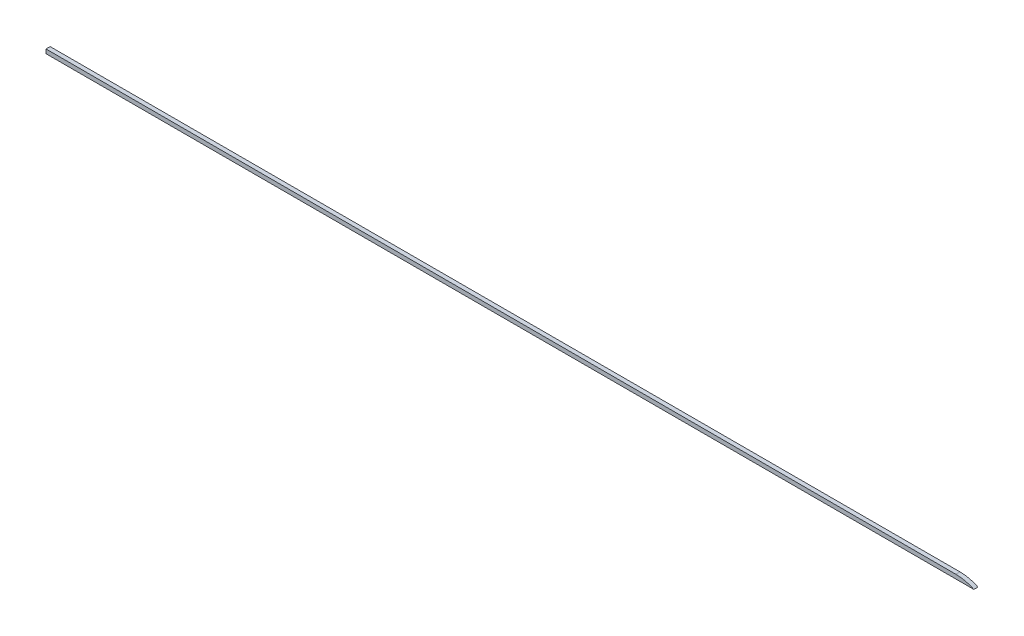
ISO-10303-21;
HEADER;
FILE_DESCRIPTION(('STEP AP214'),'2;1');
FILE_NAME('part.step','',(''),(''),'','','');
FILE_SCHEMA(('AUTOMOTIVE_DESIGN { 1 0 10303 214 1 1 1 1 }'));
ENDSEC;
DATA;
#1=APPLICATION_CONTEXT('core data for automotive mechanical design processes');
#2=APPLICATION_PROTOCOL_DEFINITION('international standard','automotive_design',2000,#1);
#3=PRODUCT_CONTEXT('',#1,'mechanical');
#4=PRODUCT('Part','Part','',(#3));
#5=PRODUCT_RELATED_PRODUCT_CATEGORY('part','',(#4));
#6=PRODUCT_DEFINITION_FORMATION('','',#4);
#7=PRODUCT_DEFINITION_CONTEXT('part definition',#1,'design');
#8=PRODUCT_DEFINITION('design','',#6,#7);
#9=PRODUCT_DEFINITION_SHAPE('','',#8);
#10=(LENGTH_UNIT() NAMED_UNIT(*) SI_UNIT(.MILLI.,.METRE.));
#11=(NAMED_UNIT(*) PLANE_ANGLE_UNIT() SI_UNIT($,.RADIAN.));
#12=(NAMED_UNIT(*) SI_UNIT($,.STERADIAN.) SOLID_ANGLE_UNIT());
#13=UNCERTAINTY_MEASURE_WITH_UNIT(LENGTH_MEASURE(1.E-05),#10,'distance_accuracy_value','');
#14=(GEOMETRIC_REPRESENTATION_CONTEXT(3) GLOBAL_UNCERTAINTY_ASSIGNED_CONTEXT((#13)) GLOBAL_UNIT_ASSIGNED_CONTEXT((#10,
#11,#12)) REPRESENTATION_CONTEXT('',''));
#15=CARTESIAN_POINT('',(0.,0.,0.));
#16=DIRECTION('',(0.,0.,1.));
#17=DIRECTION('',(1.,0.,0.));
#18=AXIS2_PLACEMENT_3D('',#15,#16,#17);
#19=CARTESIAN_POINT('',(-502.733741957931,0.,0.));
#20=DIRECTION('',(1.,0.,0.));
#21=DIRECTION('',(0.,0.,-1.));
#22=AXIS2_PLACEMENT_3D('',#19,#20,#21);
#23=PLANE('',#22);
#24=DIRECTION('',(0.,0.,1.));
#25=VECTOR('',#24,1.);
#26=CARTESIAN_POINT('',(-502.733741957931,45.,0.));
#27=LINE('',#26,#25);
#28=CARTESIAN_POINT('',(-502.733741957931,45.,0.));
#29=VERTEX_POINT('',#28);
#30=CARTESIAN_POINT('',(-502.733741957931,45.,5.));
#31=VERTEX_POINT('',#30);
#32=EDGE_CURVE('E83',#29,#31,#27,.T.);
#33=ORIENTED_EDGE('',*,*,#32,.T.);
#34=DIRECTION('',(0.,1.,0.));
#35=VECTOR('',#34,1.);
#36=CARTESIAN_POINT('',(-502.733741957931,-45.,5.));
#37=LINE('',#36,#35);
#38=CARTESIAN_POINT('',(-502.733741957931,50.,5.));
#39=VERTEX_POINT('',#38);
#40=EDGE_CURVE('E42',#31,#39,#37,.T.);
#41=ORIENTED_EDGE('',*,*,#40,.T.);
#42=DIRECTION('',(0.,0.,-1.));
#43=VECTOR('',#42,1.);
#44=CARTESIAN_POINT('',(-502.733741957931,50.,80.));
#45=LINE('',#44,#43);
#46=CARTESIAN_POINT('',(-502.733741957931,50.,0.));
#47=VERTEX_POINT('',#46);
#48=EDGE_CURVE('E11',#39,#47,#45,.T.);
#49=ORIENTED_EDGE('',*,*,#48,.T.);
#50=DIRECTION('',(0.,1.,0.));
#51=VECTOR('',#50,1.);
#52=CARTESIAN_POINT('',(-502.733741957931,0.,0.));
#53=LINE('',#52,#51);
#54=EDGE_CURVE('E37',#29,#47,#53,.T.);
#55=ORIENTED_EDGE('',*,*,#54,.F.);
#56=EDGE_LOOP('',(#33,#41,#49,#55));
#57=FACE_BOUND('',#56,.T.);
#58=ADVANCED_FACE('F34',(#57),#23,.F.);
#59=CARTESIAN_POINT('',(0.,45.,0.));
#60=DIRECTION('',(0.,-1.,0.));
#61=DIRECTION('',(0.,0.,-1.));
#62=AXIS2_PLACEMENT_3D('',#59,#60,#61);
#63=PLANE('',#62);
#64=ORIENTED_EDGE('',*,*,#32,.F.);
#65=DIRECTION('',(1.,0.,0.));
#66=VECTOR('',#65,1.);
#67=CARTESIAN_POINT('',(-502.733741957931,45.,0.));
#68=LINE('',#67,#66);
#69=CARTESIAN_POINT('',(619.060752759772,45.,0.));
#70=VERTEX_POINT('',#69);
#71=EDGE_CURVE('E75',#29,#70,#68,.T.);
#72=ORIENTED_EDGE('',*,*,#71,.T.);
#73=DIRECTION('',(0.,0.,-1.));
#74=VECTOR('',#73,1.);
#75=CARTESIAN_POINT('',(619.060752759772,45.,80.));
#76=LINE('',#75,#74);
#77=CARTESIAN_POINT('',(619.060752759772,45.,5.));
#78=VERTEX_POINT('',#77);
#79=EDGE_CURVE('E80',#70,#78,#76,.F.);
#80=ORIENTED_EDGE('',*,*,#79,.T.);
#81=DIRECTION('',(1.,0.,0.));
#82=VECTOR('',#81,1.);
#83=CARTESIAN_POINT('',(597.266258042068,45.,5.));
#84=LINE('',#83,#82);
#85=EDGE_CURVE('E84',#31,#78,#84,.T.);
#86=ORIENTED_EDGE('',*,*,#85,.F.);
#87=EDGE_LOOP('',(#64,#72,#80,#86));
#88=FACE_BOUND('',#87,.T.);
#89=ADVANCED_FACE('F77',(#88),#63,.T.);
#90=CARTESIAN_POINT('',(-502.733741957931,0.,0.));
#91=DIRECTION('',(0.,0.,1.));
#92=DIRECTION('',(1.,0.,0.));
#93=AXIS2_PLACEMENT_3D('',#90,#91,#92);
#94=PLANE('',#93);
#95=ORIENTED_EDGE('',*,*,#71,.F.);
#96=ORIENTED_EDGE('',*,*,#54,.T.);
#97=DIRECTION('',(-1.,0.,0.));
#98=VECTOR('',#97,1.);
#99=CARTESIAN_POINT('',(-502.733741957931,50.,0.));
#100=LINE('',#99,#98);
#101=CARTESIAN_POINT('',(597.266258042068,50.,0.));
#102=VERTEX_POINT('',#101);
#103=EDGE_CURVE('E88',#102,#47,#100,.T.);
#104=ORIENTED_EDGE('',*,*,#103,.F.);
#105=CARTESIAN_POINT('',(597.266258042068,0.,0.));
#106=DIRECTION('',(0.,0.,1.));
#107=DIRECTION('',(1.,0.,0.));
#108=AXIS2_PLACEMENT_3D('',#105,#106,#107);
#109=CIRCLE('',#108,50.);
#110=EDGE_CURVE('E86',#70,#102,#109,.T.);
#111=ORIENTED_EDGE('',*,*,#110,.F.);
#112=EDGE_LOOP('',(#95,#96,#104,#111));
#113=FACE_BOUND('',#112,.T.);
#114=ADVANCED_FACE('F87',(#113),#94,.F.);
#115=CARTESIAN_POINT('',(-502.733741957931,50.,80.));
#116=DIRECTION('',(0.,-1.,0.));
#117=DIRECTION('',(0.,0.,-1.));
#118=AXIS2_PLACEMENT_3D('',#115,#116,#117);
#119=PLANE('',#118);
#120=ORIENTED_EDGE('',*,*,#48,.F.);
#121=DIRECTION('',(1.,0.,0.));
#122=VECTOR('',#121,1.);
#123=CARTESIAN_POINT('',(-502.733741957931,50.,5.));
#124=LINE('',#123,#122);
#125=CARTESIAN_POINT('',(597.266258042068,50.,5.));
#126=VERTEX_POINT('',#125);
#127=EDGE_CURVE('E92',#39,#126,#124,.T.);
#128=ORIENTED_EDGE('',*,*,#127,.T.);
#129=DIRECTION('',(0.,0.,-1.));
#130=VECTOR('',#129,1.);
#131=CARTESIAN_POINT('',(597.266258042068,50.,80.));
#132=LINE('',#131,#130);
#133=EDGE_CURVE('E101',#126,#102,#132,.T.);
#134=ORIENTED_EDGE('',*,*,#133,.T.);
#135=ORIENTED_EDGE('',*,*,#103,.T.);
#136=EDGE_LOOP('',(#120,#128,#134,#135));
#137=FACE_BOUND('',#136,.T.);
#138=ADVANCED_FACE('F107',(#137),#119,.F.);
#139=CARTESIAN_POINT('',(597.266258042068,0.,80.));
#140=DIRECTION('',(0.,0.,-1.));
#141=DIRECTION('',(-1.,0.,0.));
#142=AXIS2_PLACEMENT_3D('',#139,#140,#141);
#143=CYLINDRICAL_SURFACE('',#142,50.);
#144=ORIENTED_EDGE('',*,*,#79,.F.);
#145=ORIENTED_EDGE('',*,*,#110,.T.);
#146=ORIENTED_EDGE('',*,*,#133,.F.);
#147=CARTESIAN_POINT('',(597.266258042068,0.,5.));
#148=DIRECTION('',(0.,0.,1.));
#149=DIRECTION('',(1.,0.,0.));
#150=AXIS2_PLACEMENT_3D('',#147,#148,#149);
#151=CIRCLE('',#150,50.);
#152=EDGE_CURVE('E93',#78,#126,#151,.T.);
#153=ORIENTED_EDGE('',*,*,#152,.F.);
#154=EDGE_LOOP('',(#144,#145,#146,#153));
#155=FACE_BOUND('',#154,.T.);
#156=ADVANCED_FACE('F95',(#155),#143,.T.);
#157=CARTESIAN_POINT('',(597.266258042068,-45.,5.));
#158=DIRECTION('',(0.,0.,1.));
#159=DIRECTION('',(1.,0.,0.));
#160=AXIS2_PLACEMENT_3D('',#157,#158,#159);
#161=PLANE('',#160);
#162=ORIENTED_EDGE('',*,*,#40,.F.);
#163=ORIENTED_EDGE('',*,*,#85,.T.);
#164=ORIENTED_EDGE('',*,*,#152,.T.);
#165=ORIENTED_EDGE('',*,*,#127,.F.);
#166=EDGE_LOOP('',(#162,#163,#164,#165));
#167=FACE_BOUND('',#166,.T.);
#168=ADVANCED_FACE('F105',(#167),#161,.T.);
#169=CLOSED_SHELL('',(#58,#89,#114,#138,#156,#168));
#170=MANIFOLD_SOLID_BREP('B2',#169);
#171=ADVANCED_BREP_SHAPE_REPRESENTATION('',(#18,#170),#14);
#172=SHAPE_DEFINITION_REPRESENTATION(#9,#171);
ENDSEC;
END-ISO-10303-21;
